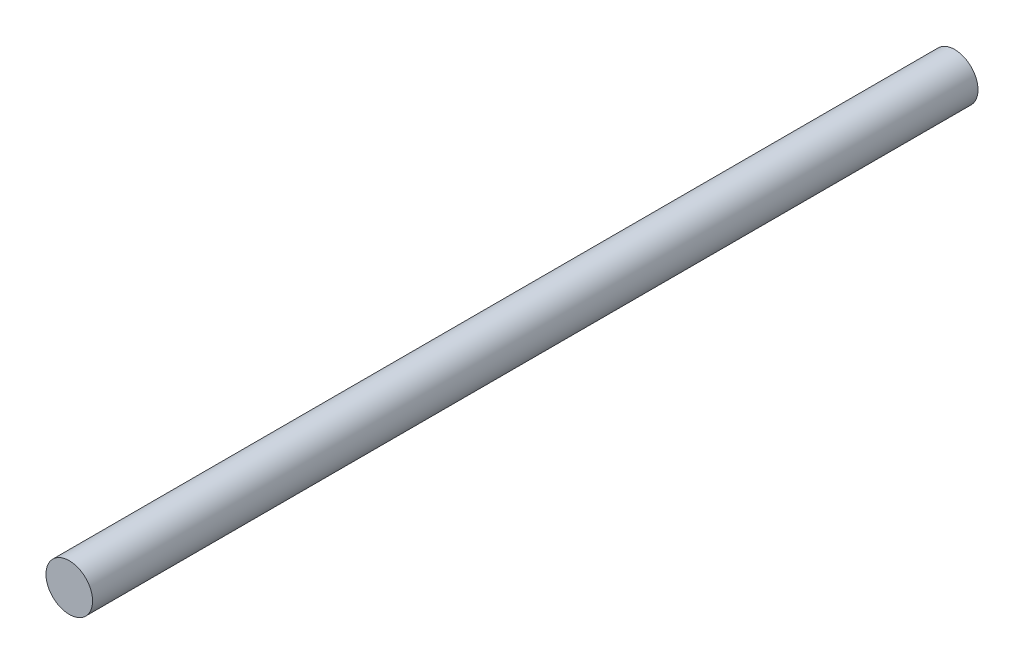
ISO-10303-21;
HEADER;
FILE_DESCRIPTION(('STEP AP214'),'2;1');
FILE_NAME('part.step','',(''),(''),'','','');
FILE_SCHEMA(('AUTOMOTIVE_DESIGN { 1 0 10303 214 1 1 1 1 }'));
ENDSEC;
DATA;
#1=APPLICATION_CONTEXT('core data for automotive mechanical design processes');
#2=APPLICATION_PROTOCOL_DEFINITION('international standard','automotive_design',2000,#1);
#3=PRODUCT_CONTEXT('',#1,'mechanical');
#4=PRODUCT('Part','Part','',(#3));
#5=PRODUCT_RELATED_PRODUCT_CATEGORY('part','',(#4));
#6=PRODUCT_DEFINITION_FORMATION('','',#4);
#7=PRODUCT_DEFINITION_CONTEXT('part definition',#1,'design');
#8=PRODUCT_DEFINITION('design','',#6,#7);
#9=PRODUCT_DEFINITION_SHAPE('','',#8);
#10=(LENGTH_UNIT() NAMED_UNIT(*) SI_UNIT(.MILLI.,.METRE.));
#11=(NAMED_UNIT(*) PLANE_ANGLE_UNIT() SI_UNIT($,.RADIAN.));
#12=(NAMED_UNIT(*) SI_UNIT($,.STERADIAN.) SOLID_ANGLE_UNIT());
#13=UNCERTAINTY_MEASURE_WITH_UNIT(LENGTH_MEASURE(1.E-05),#10,'distance_accuracy_value','');
#14=(GEOMETRIC_REPRESENTATION_CONTEXT(3) GLOBAL_UNCERTAINTY_ASSIGNED_CONTEXT((#13)) GLOBAL_UNIT_ASSIGNED_CONTEXT((#10,
#11,#12)) REPRESENTATION_CONTEXT('',''));
#15=CARTESIAN_POINT('',(0.,0.,0.));
#16=DIRECTION('',(0.,0.,1.));
#17=DIRECTION('',(1.,0.,0.));
#18=AXIS2_PLACEMENT_3D('',#15,#16,#17);
#19=CARTESIAN_POINT('',(0.,0.,57.));
#20=DIRECTION('',(0.,0.,-1.));
#21=DIRECTION('',(-1.,0.,0.));
#22=AXIS2_PLACEMENT_3D('',#19,#20,#21);
#23=CYLINDRICAL_SURFACE('',#22,1.5);
#24=CARTESIAN_POINT('',(0.,0.,57.));
#25=DIRECTION('',(0.,0.,1.));
#26=DIRECTION('',(1.,0.,0.));
#27=AXIS2_PLACEMENT_3D('',#24,#25,#26);
#28=CIRCLE('',#27,1.5);
#29=CARTESIAN_POINT('',(1.5,0.,57.));
#30=VERTEX_POINT('',#29);
#31=EDGE_CURVE('E10',#30,#30,#28,.T.);
#32=ORIENTED_EDGE('',*,*,#31,.F.);
#33=EDGE_LOOP('',(#32));
#34=FACE_BOUND('',#33,.T.);
#35=CARTESIAN_POINT('',(0.,0.,0.));
#36=DIRECTION('',(0.,0.,1.));
#37=DIRECTION('',(1.,0.,0.));
#38=AXIS2_PLACEMENT_3D('',#35,#36,#37);
#39=CIRCLE('',#38,1.5);
#40=CARTESIAN_POINT('',(1.5,0.,0.));
#41=VERTEX_POINT('',#40);
#42=EDGE_CURVE('E36',#41,#41,#39,.T.);
#43=ORIENTED_EDGE('',*,*,#42,.T.);
#44=EDGE_LOOP('',(#43));
#45=FACE_BOUND('',#44,.T.);
#46=ADVANCED_FACE('F33',(#34,#45),#23,.T.);
#47=CARTESIAN_POINT('',(0.,0.,57.));
#48=DIRECTION('',(0.,0.,1.));
#49=DIRECTION('',(1.,0.,0.));
#50=AXIS2_PLACEMENT_3D('',#47,#48,#49);
#51=PLANE('',#50);
#52=ORIENTED_EDGE('',*,*,#31,.T.);
#53=EDGE_LOOP('',(#52));
#54=FACE_BOUND('',#53,.T.);
#55=ADVANCED_FACE('F48',(#54),#51,.T.);
#56=CARTESIAN_POINT('',(0.,0.,0.));
#57=DIRECTION('',(0.,0.,1.));
#58=DIRECTION('',(1.,0.,0.));
#59=AXIS2_PLACEMENT_3D('',#56,#57,#58);
#60=PLANE('',#59);
#61=ORIENTED_EDGE('',*,*,#42,.F.);
#62=EDGE_LOOP('',(#61));
#63=FACE_BOUND('',#62,.T.);
#64=ADVANCED_FACE('F46',(#63),#60,.F.);
#65=CLOSED_SHELL('',(#46,#55,#64));
#66=MANIFOLD_SOLID_BREP('B2',#65);
#67=ADVANCED_BREP_SHAPE_REPRESENTATION('',(#18,#66),#14);
#68=SHAPE_DEFINITION_REPRESENTATION(#9,#67);
ENDSEC;
END-ISO-10303-21;
